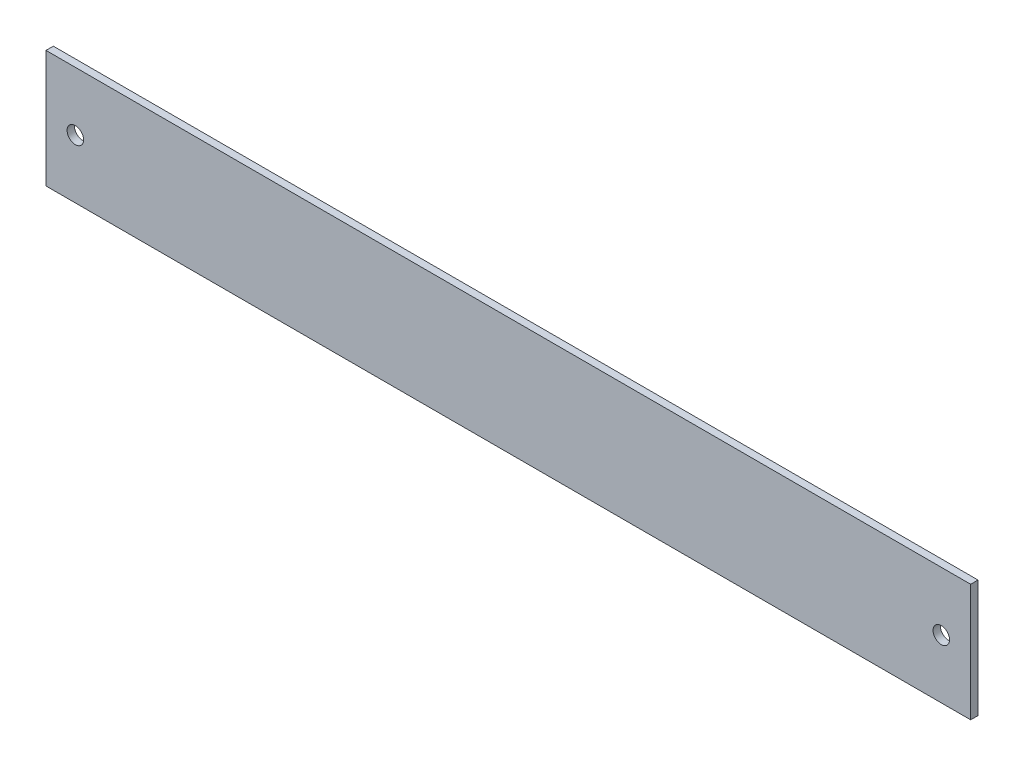
ISO-10303-21;
HEADER;
FILE_DESCRIPTION(('STEP AP214'),'2;1');
FILE_NAME('part.step','',(''),(''),'','','');
FILE_SCHEMA(('AUTOMOTIVE_DESIGN { 1 0 10303 214 1 1 1 1 }'));
ENDSEC;
DATA;
#1=APPLICATION_CONTEXT('core data for automotive mechanical design processes');
#2=APPLICATION_PROTOCOL_DEFINITION('international standard','automotive_design',2000,#1);
#3=PRODUCT_CONTEXT('',#1,'mechanical');
#4=PRODUCT('Part','Part','',(#3));
#5=PRODUCT_RELATED_PRODUCT_CATEGORY('part','',(#4));
#6=PRODUCT_DEFINITION_FORMATION('','',#4);
#7=PRODUCT_DEFINITION_CONTEXT('part definition',#1,'design');
#8=PRODUCT_DEFINITION('design','',#6,#7);
#9=PRODUCT_DEFINITION_SHAPE('','',#8);
#10=(LENGTH_UNIT() NAMED_UNIT(*) SI_UNIT(.MILLI.,.METRE.));
#11=(NAMED_UNIT(*) PLANE_ANGLE_UNIT() SI_UNIT($,.RADIAN.));
#12=(NAMED_UNIT(*) SI_UNIT($,.STERADIAN.) SOLID_ANGLE_UNIT());
#13=UNCERTAINTY_MEASURE_WITH_UNIT(LENGTH_MEASURE(1.E-05),#10,'distance_accuracy_value','');
#14=(GEOMETRIC_REPRESENTATION_CONTEXT(3) GLOBAL_UNCERTAINTY_ASSIGNED_CONTEXT((#13)) GLOBAL_UNIT_ASSIGNED_CONTEXT((#10,
#11,#12)) REPRESENTATION_CONTEXT('',''));
#15=CARTESIAN_POINT('',(0.,0.,0.));
#16=DIRECTION('',(0.,0.,1.));
#17=DIRECTION('',(1.,0.,0.));
#18=AXIS2_PLACEMENT_3D('',#15,#16,#17);
#19=CARTESIAN_POINT('',(200.,-25.4,3.175));
#20=DIRECTION('',(-1.,0.,0.));
#21=DIRECTION('',(0.,0.,1.));
#22=AXIS2_PLACEMENT_3D('',#19,#20,#21);
#23=PLANE('',#22);
#24=DIRECTION('',(0.,1.,0.));
#25=VECTOR('',#24,1.);
#26=CARTESIAN_POINT('',(200.,-25.4,0.));
#27=LINE('',#26,#25);
#28=CARTESIAN_POINT('',(200.,-25.4,0.));
#29=VERTEX_POINT('',#28);
#30=CARTESIAN_POINT('',(200.,25.4,0.));
#31=VERTEX_POINT('',#30);
#32=EDGE_CURVE('E102',#29,#31,#27,.T.);
#33=ORIENTED_EDGE('',*,*,#32,.T.);
#34=DIRECTION('',(0.,0.,-1.));
#35=VECTOR('',#34,1.);
#36=CARTESIAN_POINT('',(200.,25.4,3.175));
#37=LINE('',#36,#35);
#38=CARTESIAN_POINT('',(200.,25.4,3.175));
#39=VERTEX_POINT('',#38);
#40=EDGE_CURVE('E11',#39,#31,#37,.T.);
#41=ORIENTED_EDGE('',*,*,#40,.F.);
#42=DIRECTION('',(0.,1.,0.));
#43=VECTOR('',#42,1.);
#44=CARTESIAN_POINT('',(200.,-25.4,3.175));
#45=LINE('',#44,#43);
#46=CARTESIAN_POINT('',(200.,-25.4,3.175));
#47=VERTEX_POINT('',#46);
#48=EDGE_CURVE('E90',#47,#39,#45,.T.);
#49=ORIENTED_EDGE('',*,*,#48,.F.);
#50=DIRECTION('',(0.,0.,-1.));
#51=VECTOR('',#50,1.);
#52=CARTESIAN_POINT('',(200.,-25.4,3.175));
#53=LINE('',#52,#51);
#54=EDGE_CURVE('E98',#47,#29,#53,.T.);
#55=ORIENTED_EDGE('',*,*,#54,.T.);
#56=EDGE_LOOP('',(#33,#41,#49,#55));
#57=FACE_BOUND('',#56,.T.);
#58=ADVANCED_FACE('F39',(#57),#23,.F.);
#59=CARTESIAN_POINT('',(-200.,25.4,3.175));
#60=DIRECTION('',(0.,-1.,0.));
#61=DIRECTION('',(0.,0.,-1.));
#62=AXIS2_PLACEMENT_3D('',#59,#60,#61);
#63=PLANE('',#62);
#64=DIRECTION('',(-1.,0.,0.));
#65=VECTOR('',#64,1.);
#66=CARTESIAN_POINT('',(-200.,25.4,0.));
#67=LINE('',#66,#65);
#68=CARTESIAN_POINT('',(-200.,25.4,0.));
#69=VERTEX_POINT('',#68);
#70=EDGE_CURVE('E94',#31,#69,#67,.T.);
#71=ORIENTED_EDGE('',*,*,#70,.T.);
#72=DIRECTION('',(0.,0.,-1.));
#73=VECTOR('',#72,1.);
#74=CARTESIAN_POINT('',(-200.,25.4,3.175));
#75=LINE('',#74,#73);
#76=CARTESIAN_POINT('',(-200.,25.4,3.175));
#77=VERTEX_POINT('',#76);
#78=EDGE_CURVE('E47',#77,#69,#75,.T.);
#79=ORIENTED_EDGE('',*,*,#78,.F.);
#80=DIRECTION('',(-1.,0.,0.));
#81=VECTOR('',#80,1.);
#82=CARTESIAN_POINT('',(-200.,25.4,3.175));
#83=LINE('',#82,#81);
#84=EDGE_CURVE('E85',#39,#77,#83,.T.);
#85=ORIENTED_EDGE('',*,*,#84,.F.);
#86=ORIENTED_EDGE('',*,*,#40,.T.);
#87=EDGE_LOOP('',(#71,#79,#85,#86));
#88=FACE_BOUND('',#87,.T.);
#89=ADVANCED_FACE('F93',(#88),#63,.F.);
#90=CARTESIAN_POINT('',(-200.,-25.4,3.175));
#91=DIRECTION('',(1.,0.,0.));
#92=DIRECTION('',(0.,0.,-1.));
#93=AXIS2_PLACEMENT_3D('',#90,#91,#92);
#94=PLANE('',#93);
#95=DIRECTION('',(0.,-1.,0.));
#96=VECTOR('',#95,1.);
#97=CARTESIAN_POINT('',(-200.,-25.4,0.));
#98=LINE('',#97,#96);
#99=CARTESIAN_POINT('',(-200.,-25.4,0.));
#100=VERTEX_POINT('',#99);
#101=EDGE_CURVE('E72',#69,#100,#98,.T.);
#102=ORIENTED_EDGE('',*,*,#101,.T.);
#103=DIRECTION('',(0.,0.,-1.));
#104=VECTOR('',#103,1.);
#105=CARTESIAN_POINT('',(-200.,-25.4,3.175));
#106=LINE('',#105,#104);
#107=CARTESIAN_POINT('',(-200.,-25.4,3.175));
#108=VERTEX_POINT('',#107);
#109=EDGE_CURVE('E95',#108,#100,#106,.T.);
#110=ORIENTED_EDGE('',*,*,#109,.F.);
#111=DIRECTION('',(0.,-1.,0.));
#112=VECTOR('',#111,1.);
#113=CARTESIAN_POINT('',(-200.,-25.4,3.175));
#114=LINE('',#113,#112);
#115=EDGE_CURVE('E88',#77,#108,#114,.T.);
#116=ORIENTED_EDGE('',*,*,#115,.F.);
#117=ORIENTED_EDGE('',*,*,#78,.T.);
#118=EDGE_LOOP('',(#102,#110,#116,#117));
#119=FACE_BOUND('',#118,.T.);
#120=ADVANCED_FACE('F96',(#119),#94,.F.);
#121=CARTESIAN_POINT('',(-200.,-25.4,3.175));
#122=DIRECTION('',(0.,1.,0.));
#123=DIRECTION('',(0.,0.,1.));
#124=AXIS2_PLACEMENT_3D('',#121,#122,#123);
#125=PLANE('',#124);
#126=DIRECTION('',(1.,0.,0.));
#127=VECTOR('',#126,1.);
#128=CARTESIAN_POINT('',(-200.,-25.4,0.));
#129=LINE('',#128,#127);
#130=EDGE_CURVE('E78',#100,#29,#129,.T.);
#131=ORIENTED_EDGE('',*,*,#130,.T.);
#132=ORIENTED_EDGE('',*,*,#54,.F.);
#133=DIRECTION('',(1.,0.,0.));
#134=VECTOR('',#133,1.);
#135=CARTESIAN_POINT('',(-200.,-25.4,3.175));
#136=LINE('',#135,#134);
#137=EDGE_CURVE('E55',#108,#47,#136,.T.);
#138=ORIENTED_EDGE('',*,*,#137,.F.);
#139=ORIENTED_EDGE('',*,*,#109,.T.);
#140=EDGE_LOOP('',(#131,#132,#138,#139));
#141=FACE_BOUND('',#140,.T.);
#142=ADVANCED_FACE('F110',(#141),#125,.F.);
#143=CARTESIAN_POINT('',(0.,0.,3.175));
#144=DIRECTION('',(0.,0.,-1.));
#145=DIRECTION('',(-1.,0.,0.));
#146=AXIS2_PLACEMENT_3D('',#143,#144,#145);
#147=PLANE('',#146);
#148=CARTESIAN_POINT('',(-187.3,0.,3.175));
#149=DIRECTION('',(0.,0.,1.));
#150=DIRECTION('',(1.,0.,0.));
#151=AXIS2_PLACEMENT_3D('',#148,#149,#150);
#152=CIRCLE('',#151,3.56870000000001);
#153=CARTESIAN_POINT('',(-183.7313,0.,3.175));
#154=VERTEX_POINT('',#153);
#155=EDGE_CURVE('E122',#154,#154,#152,.T.);
#156=ORIENTED_EDGE('',*,*,#155,.F.);
#157=EDGE_LOOP('',(#156));
#158=FACE_BOUND('',#157,.T.);
#159=CARTESIAN_POINT('',(187.3,0.,3.175));
#160=DIRECTION('',(0.,0.,1.));
#161=DIRECTION('',(1.,0.,0.));
#162=AXIS2_PLACEMENT_3D('',#159,#160,#161);
#163=CIRCLE('',#162,3.56870000000001);
#164=CARTESIAN_POINT('',(190.8687,0.,3.175));
#165=VERTEX_POINT('',#164);
#166=EDGE_CURVE('E119',#165,#165,#163,.T.);
#167=ORIENTED_EDGE('',*,*,#166,.F.);
#168=EDGE_LOOP('',(#167));
#169=FACE_BOUND('',#168,.T.);
#170=ORIENTED_EDGE('',*,*,#48,.T.);
#171=ORIENTED_EDGE('',*,*,#84,.T.);
#172=ORIENTED_EDGE('',*,*,#115,.T.);
#173=ORIENTED_EDGE('',*,*,#137,.T.);
#174=EDGE_LOOP('',(#170,#171,#172,#173));
#175=FACE_BOUND('',#174,.T.);
#176=ADVANCED_FACE('F86',(#158,#169,#175),#147,.F.);
#177=CARTESIAN_POINT('',(0.,0.,0.));
#178=DIRECTION('',(0.,0.,-1.));
#179=DIRECTION('',(-1.,0.,0.));
#180=AXIS2_PLACEMENT_3D('',#177,#178,#179);
#181=PLANE('',#180);
#182=CARTESIAN_POINT('',(-187.3,0.,0.));
#183=DIRECTION('',(0.,0.,1.));
#184=DIRECTION('',(1.,0.,0.));
#185=AXIS2_PLACEMENT_3D('',#182,#183,#184);
#186=CIRCLE('',#185,3.56870000000001);
#187=CARTESIAN_POINT('',(-183.7313,0.,0.));
#188=VERTEX_POINT('',#187);
#189=EDGE_CURVE('E105',#188,#188,#186,.T.);
#190=ORIENTED_EDGE('',*,*,#189,.T.);
#191=EDGE_LOOP('',(#190));
#192=FACE_BOUND('',#191,.T.);
#193=CARTESIAN_POINT('',(187.3,0.,0.));
#194=DIRECTION('',(0.,0.,1.));
#195=DIRECTION('',(1.,0.,0.));
#196=AXIS2_PLACEMENT_3D('',#193,#194,#195);
#197=CIRCLE('',#196,3.56870000000001);
#198=CARTESIAN_POINT('',(190.8687,0.,0.));
#199=VERTEX_POINT('',#198);
#200=EDGE_CURVE('E116',#199,#199,#197,.T.);
#201=ORIENTED_EDGE('',*,*,#200,.T.);
#202=EDGE_LOOP('',(#201));
#203=FACE_BOUND('',#202,.T.);
#204=ORIENTED_EDGE('',*,*,#32,.F.);
#205=ORIENTED_EDGE('',*,*,#130,.F.);
#206=ORIENTED_EDGE('',*,*,#101,.F.);
#207=ORIENTED_EDGE('',*,*,#70,.F.);
#208=EDGE_LOOP('',(#204,#205,#206,#207));
#209=FACE_BOUND('',#208,.T.);
#210=ADVANCED_FACE('F113',(#192,#203,#209),#181,.T.);
#211=CARTESIAN_POINT('',(187.3,0.,0.));
#212=DIRECTION('',(0.,0.,1.));
#213=DIRECTION('',(1.,0.,0.));
#214=AXIS2_PLACEMENT_3D('',#211,#212,#213);
#215=CYLINDRICAL_SURFACE('',#214,3.56870000000001);
#216=ORIENTED_EDGE('',*,*,#200,.F.);
#217=EDGE_LOOP('',(#216));
#218=FACE_BOUND('',#217,.T.);
#219=ORIENTED_EDGE('',*,*,#166,.T.);
#220=EDGE_LOOP('',(#219));
#221=FACE_BOUND('',#220,.T.);
#222=ADVANCED_FACE('F133',(#218,#221),#215,.F.);
#223=CARTESIAN_POINT('',(-187.3,0.,0.));
#224=DIRECTION('',(0.,0.,1.));
#225=DIRECTION('',(1.,0.,0.));
#226=AXIS2_PLACEMENT_3D('',#223,#224,#225);
#227=CYLINDRICAL_SURFACE('',#226,3.56870000000001);
#228=ORIENTED_EDGE('',*,*,#189,.F.);
#229=EDGE_LOOP('',(#228));
#230=FACE_BOUND('',#229,.T.);
#231=ORIENTED_EDGE('',*,*,#155,.T.);
#232=EDGE_LOOP('',(#231));
#233=FACE_BOUND('',#232,.T.);
#234=ADVANCED_FACE('F130',(#230,#233),#227,.F.);
#235=CLOSED_SHELL('',(#58,#89,#120,#142,#176,#210,#222,#234));
#236=MANIFOLD_SOLID_BREP('B2',#235);
#237=ADVANCED_BREP_SHAPE_REPRESENTATION('',(#18,#236),#14);
#238=SHAPE_DEFINITION_REPRESENTATION(#9,#237);
ENDSEC;
END-ISO-10303-21;
